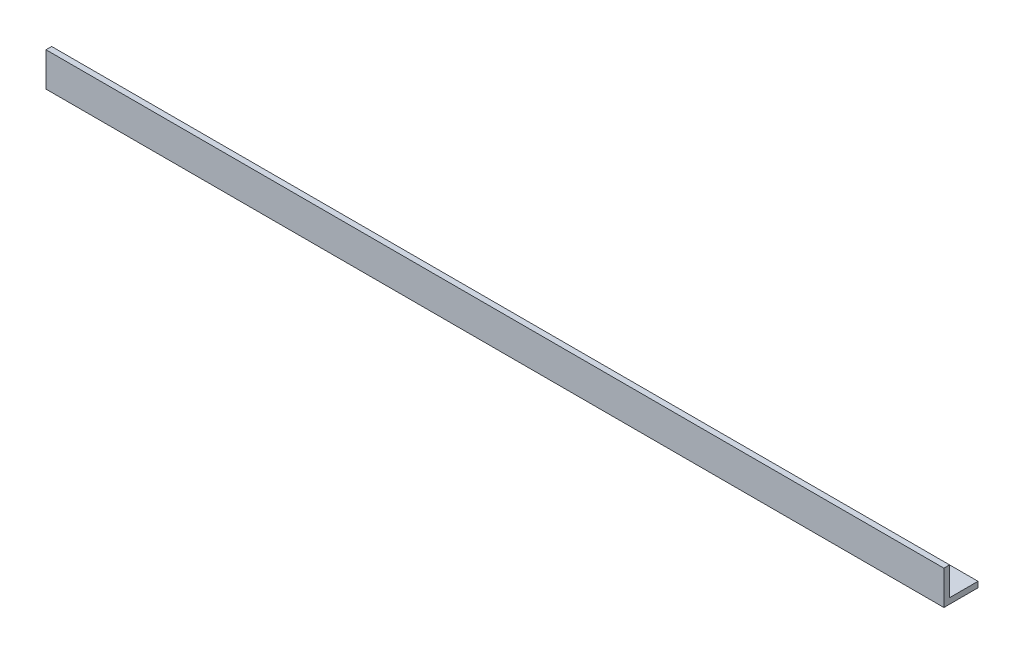
ISO-10303-21;
HEADER;
FILE_DESCRIPTION(('STEP AP214'),'2;1');
FILE_NAME('part.step','',(''),(''),'','','');
FILE_SCHEMA(('AUTOMOTIVE_DESIGN { 1 0 10303 214 1 1 1 1 }'));
ENDSEC;
DATA;
#1=APPLICATION_CONTEXT('core data for automotive mechanical design processes');
#2=APPLICATION_PROTOCOL_DEFINITION('international standard','automotive_design',2000,#1);
#3=PRODUCT_CONTEXT('',#1,'mechanical');
#4=PRODUCT('Part','Part','',(#3));
#5=PRODUCT_RELATED_PRODUCT_CATEGORY('part','',(#4));
#6=PRODUCT_DEFINITION_FORMATION('','',#4);
#7=PRODUCT_DEFINITION_CONTEXT('part definition',#1,'design');
#8=PRODUCT_DEFINITION('design','',#6,#7);
#9=PRODUCT_DEFINITION_SHAPE('','',#8);
#10=(LENGTH_UNIT() NAMED_UNIT(*) SI_UNIT(.MILLI.,.METRE.));
#11=(NAMED_UNIT(*) PLANE_ANGLE_UNIT() SI_UNIT($,.RADIAN.));
#12=(NAMED_UNIT(*) SI_UNIT($,.STERADIAN.) SOLID_ANGLE_UNIT());
#13=UNCERTAINTY_MEASURE_WITH_UNIT(LENGTH_MEASURE(1.E-05),#10,'distance_accuracy_value','');
#14=(GEOMETRIC_REPRESENTATION_CONTEXT(3) GLOBAL_UNCERTAINTY_ASSIGNED_CONTEXT((#13)) GLOBAL_UNIT_ASSIGNED_CONTEXT((#10,
#11,#12)) REPRESENTATION_CONTEXT('',''));
#15=CARTESIAN_POINT('',(0.,0.,0.));
#16=DIRECTION('',(0.,0.,1.));
#17=DIRECTION('',(1.,0.,0.));
#18=AXIS2_PLACEMENT_3D('',#15,#16,#17);
#19=CARTESIAN_POINT('',(39.5,0.,0.));
#20=DIRECTION('',(0.,-1.,0.));
#21=DIRECTION('',(0.,0.,-1.));
#22=AXIS2_PLACEMENT_3D('',#19,#20,#21);
#23=PLANE('',#22);
#24=DIRECTION('',(0.,0.,1.));
#25=VECTOR('',#24,1.);
#26=CARTESIAN_POINT('',(0.,0.,0.));
#27=LINE('',#26,#25);
#28=CARTESIAN_POINT('',(0.,0.,-1.25));
#29=VERTEX_POINT('',#28);
#30=CARTESIAN_POINT('',(0.,0.,0.));
#31=VERTEX_POINT('',#30);
#32=EDGE_CURVE('E134',#29,#31,#27,.T.);
#33=ORIENTED_EDGE('',*,*,#32,.T.);
#34=DIRECTION('',(-1.,0.,0.));
#35=VECTOR('',#34,1.);
#36=CARTESIAN_POINT('',(39.5,0.,0.));
#37=LINE('',#36,#35);
#38=CARTESIAN_POINT('',(39.5,0.,0.));
#39=VERTEX_POINT('',#38);
#40=EDGE_CURVE('E11',#39,#31,#37,.T.);
#41=ORIENTED_EDGE('',*,*,#40,.F.);
#42=DIRECTION('',(0.,0.,1.));
#43=VECTOR('',#42,1.);
#44=CARTESIAN_POINT('',(39.5,0.,0.));
#45=LINE('',#44,#43);
#46=CARTESIAN_POINT('',(39.5,0.,-1.25));
#47=VERTEX_POINT('',#46);
#48=EDGE_CURVE('E150',#47,#39,#45,.T.);
#49=ORIENTED_EDGE('',*,*,#48,.F.);
#50=DIRECTION('',(-1.,0.,0.));
#51=VECTOR('',#50,1.);
#52=CARTESIAN_POINT('',(39.5,0.,-1.25));
#53=LINE('',#52,#51);
#54=EDGE_CURVE('E130',#47,#29,#53,.T.);
#55=ORIENTED_EDGE('',*,*,#54,.T.);
#56=EDGE_LOOP('',(#33,#41,#49,#55));
#57=FACE_BOUND('',#56,.T.);
#58=ADVANCED_FACE('F45',(#57),#23,.F.);
#59=CARTESIAN_POINT('',(39.5,0.,0.));
#60=DIRECTION('',(0.,0.,1.));
#61=DIRECTION('',(1.,0.,0.));
#62=AXIS2_PLACEMENT_3D('',#59,#60,#61);
#63=PLANE('',#62);
#64=DIRECTION('',(0.,1.,0.));
#65=VECTOR('',#64,1.);
#66=CARTESIAN_POINT('',(0.,0.,0.));
#67=LINE('',#66,#65);
#68=CARTESIAN_POINT('',(0.,1.25,0.));
#69=VERTEX_POINT('',#68);
#70=EDGE_CURVE('E138',#31,#69,#67,.T.);
#71=ORIENTED_EDGE('',*,*,#70,.T.);
#72=DIRECTION('',(-1.,0.,0.));
#73=VECTOR('',#72,1.);
#74=CARTESIAN_POINT('',(39.5,1.25,0.));
#75=LINE('',#74,#73);
#76=CARTESIAN_POINT('',(39.5,1.25,0.));
#77=VERTEX_POINT('',#76);
#78=EDGE_CURVE('E54',#77,#69,#75,.T.);
#79=ORIENTED_EDGE('',*,*,#78,.F.);
#80=DIRECTION('',(0.,1.,0.));
#81=VECTOR('',#80,1.);
#82=CARTESIAN_POINT('',(39.5,0.,0.));
#83=LINE('',#82,#81);
#84=EDGE_CURVE('E99',#39,#77,#83,.T.);
#85=ORIENTED_EDGE('',*,*,#84,.F.);
#86=ORIENTED_EDGE('',*,*,#40,.T.);
#87=EDGE_LOOP('',(#71,#79,#85,#86));
#88=FACE_BOUND('',#87,.T.);
#89=ADVANCED_FACE('F178',(#88),#63,.F.);
#90=CARTESIAN_POINT('',(39.5,1.25,0.));
#91=DIRECTION('',(0.,-1.,0.));
#92=DIRECTION('',(0.,0.,-1.));
#93=AXIS2_PLACEMENT_3D('',#90,#91,#92);
#94=PLANE('',#93);
#95=DIRECTION('',(0.,0.,1.));
#96=VECTOR('',#95,1.);
#97=CARTESIAN_POINT('',(0.,1.25,0.));
#98=LINE('',#97,#96);
#99=CARTESIAN_POINT('',(0.,1.25,0.25));
#100=VERTEX_POINT('',#99);
#101=EDGE_CURVE('E141',#69,#100,#98,.T.);
#102=ORIENTED_EDGE('',*,*,#101,.T.);
#103=DIRECTION('',(-1.,0.,0.));
#104=VECTOR('',#103,1.);
#105=CARTESIAN_POINT('',(39.5,1.25,0.25));
#106=LINE('',#105,#104);
#107=CARTESIAN_POINT('',(39.5,1.25,0.25));
#108=VERTEX_POINT('',#107);
#109=EDGE_CURVE('E123',#108,#100,#106,.T.);
#110=ORIENTED_EDGE('',*,*,#109,.F.);
#111=DIRECTION('',(0.,0.,1.));
#112=VECTOR('',#111,1.);
#113=CARTESIAN_POINT('',(39.5,1.25,0.));
#114=LINE('',#113,#112);
#115=EDGE_CURVE('E112',#77,#108,#114,.T.);
#116=ORIENTED_EDGE('',*,*,#115,.F.);
#117=ORIENTED_EDGE('',*,*,#78,.T.);
#118=EDGE_LOOP('',(#102,#110,#116,#117));
#119=FACE_BOUND('',#118,.T.);
#120=ADVANCED_FACE('F160',(#119),#94,.F.);
#121=CARTESIAN_POINT('',(39.5,1.25,0.25));
#122=DIRECTION('',(0.,0.,-1.));
#123=DIRECTION('',(0.,1.,0.));
#124=AXIS2_PLACEMENT_3D('',#121,#122,#123);
#125=PLANE('',#124);
#126=DIRECTION('',(0.,-1.,0.));
#127=VECTOR('',#126,1.);
#128=CARTESIAN_POINT('',(0.,1.25,0.25));
#129=LINE('',#128,#127);
#130=CARTESIAN_POINT('',(0.,-0.250000000000003,0.25));
#131=VERTEX_POINT('',#130);
#132=EDGE_CURVE('E121',#100,#131,#129,.T.);
#133=ORIENTED_EDGE('',*,*,#132,.T.);
#134=DIRECTION('',(-1.,0.,0.));
#135=VECTOR('',#134,1.);
#136=CARTESIAN_POINT('',(39.5,-0.250000000000003,0.25));
#137=LINE('',#136,#135);
#138=CARTESIAN_POINT('',(39.5,-0.250000000000003,0.25));
#139=VERTEX_POINT('',#138);
#140=EDGE_CURVE('E118',#139,#131,#137,.T.);
#141=ORIENTED_EDGE('',*,*,#140,.F.);
#142=DIRECTION('',(0.,-1.,0.));
#143=VECTOR('',#142,1.);
#144=CARTESIAN_POINT('',(39.5,1.25,0.25));
#145=LINE('',#144,#143);
#146=EDGE_CURVE('E106',#108,#139,#145,.T.);
#147=ORIENTED_EDGE('',*,*,#146,.F.);
#148=ORIENTED_EDGE('',*,*,#109,.T.);
#149=EDGE_LOOP('',(#133,#141,#147,#148));
#150=FACE_BOUND('',#149,.T.);
#151=ADVANCED_FACE('F119',(#150),#125,.F.);
#152=CARTESIAN_POINT('',(39.5,-0.249999999999987,-1.25));
#153=DIRECTION('',(0.,1.,0.));
#154=DIRECTION('',(0.,0.,1.));
#155=AXIS2_PLACEMENT_3D('',#152,#153,#154);
#156=PLANE('',#155);
#157=DIRECTION('',(0.,0.,-1.));
#158=VECTOR('',#157,1.);
#159=CARTESIAN_POINT('',(0.,-0.249999999999987,-1.25));
#160=LINE('',#159,#158);
#161=CARTESIAN_POINT('',(0.,-0.249999999999987,-1.25));
#162=VERTEX_POINT('',#161);
#163=EDGE_CURVE('E85',#131,#162,#160,.T.);
#164=ORIENTED_EDGE('',*,*,#163,.T.);
#165=DIRECTION('',(-1.,0.,0.));
#166=VECTOR('',#165,1.);
#167=CARTESIAN_POINT('',(39.5,-0.249999999999987,-1.25));
#168=LINE('',#167,#166);
#169=CARTESIAN_POINT('',(39.5,-0.249999999999987,-1.25));
#170=VERTEX_POINT('',#169);
#171=EDGE_CURVE('E124',#170,#162,#168,.T.);
#172=ORIENTED_EDGE('',*,*,#171,.F.);
#173=DIRECTION('',(0.,0.,-1.));
#174=VECTOR('',#173,1.);
#175=CARTESIAN_POINT('',(39.5,-0.249999999999987,-1.25));
#176=LINE('',#175,#174);
#177=EDGE_CURVE('E110',#139,#170,#176,.T.);
#178=ORIENTED_EDGE('',*,*,#177,.F.);
#179=ORIENTED_EDGE('',*,*,#140,.T.);
#180=EDGE_LOOP('',(#164,#172,#178,#179));
#181=FACE_BOUND('',#180,.T.);
#182=ADVANCED_FACE('F126',(#181),#156,.F.);
#183=CARTESIAN_POINT('',(39.5,0.,-1.25));
#184=DIRECTION('',(0.,0.,1.));
#185=DIRECTION('',(0.,-1.,0.));
#186=AXIS2_PLACEMENT_3D('',#183,#184,#185);
#187=PLANE('',#186);
#188=DIRECTION('',(0.,1.,0.));
#189=VECTOR('',#188,1.);
#190=CARTESIAN_POINT('',(0.,0.,-1.25));
#191=LINE('',#190,#189);
#192=EDGE_CURVE('E91',#162,#29,#191,.T.);
#193=ORIENTED_EDGE('',*,*,#192,.T.);
#194=ORIENTED_EDGE('',*,*,#54,.F.);
#195=DIRECTION('',(0.,1.,0.));
#196=VECTOR('',#195,1.);
#197=CARTESIAN_POINT('',(39.5,0.,-1.25));
#198=LINE('',#197,#196);
#199=EDGE_CURVE('E62',#170,#47,#198,.T.);
#200=ORIENTED_EDGE('',*,*,#199,.F.);
#201=ORIENTED_EDGE('',*,*,#171,.T.);
#202=EDGE_LOOP('',(#193,#194,#200,#201));
#203=FACE_BOUND('',#202,.T.);
#204=ADVANCED_FACE('F167',(#203),#187,.F.);
#205=CARTESIAN_POINT('',(39.5,0.,0.));
#206=DIRECTION('',(-1.,0.,0.));
#207=DIRECTION('',(0.,0.,1.));
#208=AXIS2_PLACEMENT_3D('',#205,#206,#207);
#209=PLANE('',#208);
#210=ORIENTED_EDGE('',*,*,#48,.T.);
#211=ORIENTED_EDGE('',*,*,#84,.T.);
#212=ORIENTED_EDGE('',*,*,#115,.T.);
#213=ORIENTED_EDGE('',*,*,#146,.T.);
#214=ORIENTED_EDGE('',*,*,#177,.T.);
#215=ORIENTED_EDGE('',*,*,#199,.T.);
#216=EDGE_LOOP('',(#210,#211,#212,#213,#214,#215));
#217=FACE_BOUND('',#216,.T.);
#218=ADVANCED_FACE('F108',(#217),#209,.F.);
#219=CARTESIAN_POINT('',(0.,0.,0.));
#220=DIRECTION('',(-1.,0.,0.));
#221=DIRECTION('',(0.,0.,1.));
#222=AXIS2_PLACEMENT_3D('',#219,#220,#221);
#223=PLANE('',#222);
#224=ORIENTED_EDGE('',*,*,#32,.F.);
#225=ORIENTED_EDGE('',*,*,#192,.F.);
#226=ORIENTED_EDGE('',*,*,#163,.F.);
#227=ORIENTED_EDGE('',*,*,#132,.F.);
#228=ORIENTED_EDGE('',*,*,#101,.F.);
#229=ORIENTED_EDGE('',*,*,#70,.F.);
#230=EDGE_LOOP('',(#224,#225,#226,#227,#228,#229));
#231=FACE_BOUND('',#230,.T.);
#232=ADVANCED_FACE('F163',(#231),#223,.T.);
#233=CLOSED_SHELL('',(#58,#89,#120,#151,#182,#204,#218,#232));
#234=MANIFOLD_SOLID_BREP('B2',#233);
#235=ADVANCED_BREP_SHAPE_REPRESENTATION('',(#18,#234),#14);
#236=SHAPE_DEFINITION_REPRESENTATION(#9,#235);
ENDSEC;
END-ISO-10303-21;
